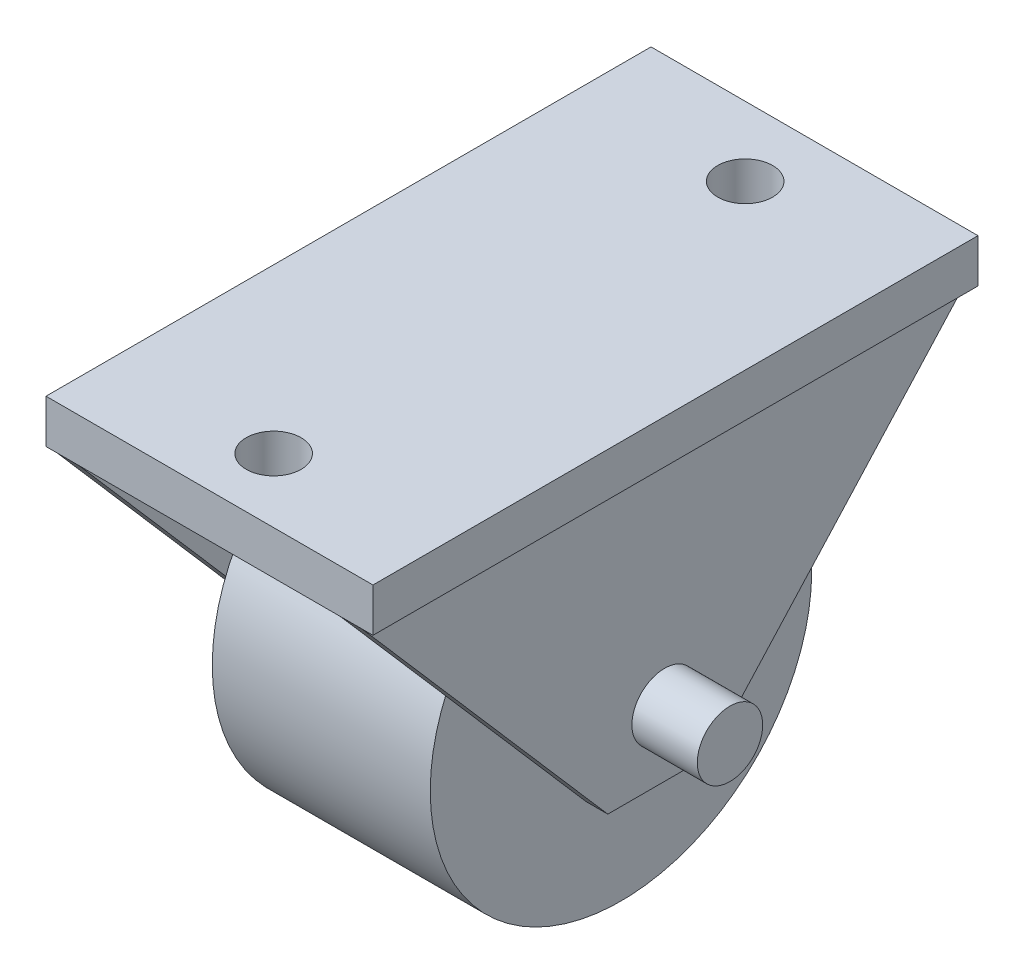
ISO-10303-21;
HEADER;
FILE_DESCRIPTION(('STEP AP214'),'2;1');
FILE_NAME('part.step','',(''),(''),'','','');
FILE_SCHEMA(('AUTOMOTIVE_DESIGN { 1 0 10303 214 1 1 1 1 }'));
ENDSEC;
DATA;
#1=APPLICATION_CONTEXT('core data for automotive mechanical design processes');
#2=APPLICATION_PROTOCOL_DEFINITION('international standard','automotive_design',2000,#1);
#3=PRODUCT_CONTEXT('',#1,'mechanical');
#4=PRODUCT('Part','Part','',(#3));
#5=PRODUCT_RELATED_PRODUCT_CATEGORY('part','',(#4));
#6=PRODUCT_DEFINITION_FORMATION('','',#4);
#7=PRODUCT_DEFINITION_CONTEXT('part definition',#1,'design');
#8=PRODUCT_DEFINITION('design','',#6,#7);
#9=PRODUCT_DEFINITION_SHAPE('','',#8);
#10=(LENGTH_UNIT() NAMED_UNIT(*) SI_UNIT(.MILLI.,.METRE.));
#11=(NAMED_UNIT(*) PLANE_ANGLE_UNIT() SI_UNIT($,.RADIAN.));
#12=(NAMED_UNIT(*) SI_UNIT($,.STERADIAN.) SOLID_ANGLE_UNIT());
#13=UNCERTAINTY_MEASURE_WITH_UNIT(LENGTH_MEASURE(1.E-05),#10,'distance_accuracy_value','');
#14=(GEOMETRIC_REPRESENTATION_CONTEXT(3) GLOBAL_UNCERTAINTY_ASSIGNED_CONTEXT((#13)) GLOBAL_UNIT_ASSIGNED_CONTEXT((#10,
#11,#12)) REPRESENTATION_CONTEXT('',''));
#15=CARTESIAN_POINT('',(0.,0.,0.));
#16=DIRECTION('',(0.,0.,1.));
#17=DIRECTION('',(1.,0.,0.));
#18=AXIS2_PLACEMENT_3D('',#15,#16,#17);
#19=CARTESIAN_POINT('',(0.,10.,0.));
#20=DIRECTION('',(0.,-1.,0.));
#21=DIRECTION('',(0.,0.,-1.));
#22=AXIS2_PLACEMENT_3D('',#19,#20,#21);
#23=PLANE('',#22);
#24=DIRECTION('',(-1.,0.,0.));
#25=VECTOR('',#24,1.);
#26=CARTESIAN_POINT('',(-7.5,10.,-13.8779468739856));
#27=LINE('',#26,#25);
#28=CARTESIAN_POINT('',(-7.,10.,-13.8779468739856));
#29=VERTEX_POINT('',#28);
#30=CARTESIAN_POINT('',(-7.5,10.,-13.8779468739856));
#31=VERTEX_POINT('',#30);
#32=EDGE_CURVE('E169',#29,#31,#27,.T.);
#33=ORIENTED_EDGE('',*,*,#32,.F.);
#34=DIRECTION('',(0.,0.,1.));
#35=VECTOR('',#34,1.);
#36=CARTESIAN_POINT('',(-7.,10.,-13.8779468739856));
#37=LINE('',#36,#35);
#38=CARTESIAN_POINT('',(-7.,10.,13.8779468739856));
#39=VERTEX_POINT('',#38);
#40=EDGE_CURVE('E158',#29,#39,#37,.T.);
#41=ORIENTED_EDGE('',*,*,#40,.T.);
#42=DIRECTION('',(1.,0.,0.));
#43=VECTOR('',#42,1.);
#44=CARTESIAN_POINT('',(-7.5,10.,13.8779468739856));
#45=LINE('',#44,#43);
#46=CARTESIAN_POINT('',(-7.5,10.,13.8779468739856));
#47=VERTEX_POINT('',#46);
#48=EDGE_CURVE('E168',#47,#39,#45,.T.);
#49=ORIENTED_EDGE('',*,*,#48,.F.);
#50=DIRECTION('',(0.,0.,1.));
#51=VECTOR('',#50,1.);
#52=CARTESIAN_POINT('',(-7.5,10.,13.8779468739856));
#53=LINE('',#52,#51);
#54=EDGE_CURVE('E192',#31,#47,#53,.T.);
#55=ORIENTED_EDGE('',*,*,#54,.F.);
#56=EDGE_LOOP('',(#33,#41,#49,#55));
#57=FACE_BOUND('',#56,.T.);
#58=ADVANCED_FACE('F39',(#57),#23,.T.);
#59=CARTESIAN_POINT('',(-10.,0.,0.));
#60=DIRECTION('',(1.,0.,0.));
#61=DIRECTION('',(0.,0.,-1.));
#62=AXIS2_PLACEMENT_3D('',#59,#60,#61);
#63=CYLINDRICAL_SURFACE('',#62,1.5);
#64=CARTESIAN_POINT('',(5.,0.,0.));
#65=DIRECTION('',(1.,0.,0.));
#66=DIRECTION('',(0.,0.,-1.));
#67=AXIS2_PLACEMENT_3D('',#64,#65,#66);
#68=CIRCLE('',#67,1.5);
#69=CARTESIAN_POINT('',(5.,0.,-1.5));
#70=VERTEX_POINT('',#69);
#71=EDGE_CURVE('E337',#70,#70,#68,.T.);
#72=ORIENTED_EDGE('',*,*,#71,.T.);
#73=EDGE_LOOP('',(#72));
#74=FACE_BOUND('',#73,.T.);
#75=CARTESIAN_POINT('',(6.,0.,0.));
#76=DIRECTION('',(1.,0.,0.));
#77=DIRECTION('',(0.,0.,-1.));
#78=AXIS2_PLACEMENT_3D('',#75,#76,#77);
#79=CIRCLE('',#78,1.5);
#80=CARTESIAN_POINT('',(6.,0.,-1.5));
#81=VERTEX_POINT('',#80);
#82=EDGE_CURVE('E324',#81,#81,#79,.F.);
#83=ORIENTED_EDGE('',*,*,#82,.T.);
#84=EDGE_LOOP('',(#83));
#85=FACE_BOUND('',#84,.T.);
#86=ADVANCED_FACE('F352',(#74,#85),#63,.T.);
#87=CARTESIAN_POINT('',(5.,0.,0.));
#88=DIRECTION('',(1.,0.,0.));
#89=DIRECTION('',(0.,0.,-1.));
#90=AXIS2_PLACEMENT_3D('',#87,#88,#89);
#91=PLANE('',#90);
#92=CARTESIAN_POINT('',(5.,0.,0.));
#93=DIRECTION('',(1.,0.,0.));
#94=DIRECTION('',(0.,0.,-1.));
#95=AXIS2_PLACEMENT_3D('',#92,#93,#94);
#96=CIRCLE('',#95,8.75);
#97=CARTESIAN_POINT('',(5.,0.,-8.75));
#98=VERTEX_POINT('',#97);
#99=EDGE_CURVE('E342',#98,#98,#96,.T.);
#100=ORIENTED_EDGE('',*,*,#99,.T.);
#101=EDGE_LOOP('',(#100));
#102=FACE_BOUND('',#101,.T.);
#103=ORIENTED_EDGE('',*,*,#71,.F.);
#104=EDGE_LOOP('',(#103));
#105=FACE_BOUND('',#104,.T.);
#106=ADVANCED_FACE('F433',(#102,#105),#91,.T.);
#107=CARTESIAN_POINT('',(-5.,0.,0.));
#108=DIRECTION('',(1.,0.,0.));
#109=DIRECTION('',(0.,0.,-1.));
#110=AXIS2_PLACEMENT_3D('',#107,#108,#109);
#111=PLANE('',#110);
#112=CARTESIAN_POINT('',(-5.,0.,0.));
#113=DIRECTION('',(1.,0.,0.));
#114=DIRECTION('',(0.,0.,-1.));
#115=AXIS2_PLACEMENT_3D('',#112,#113,#114);
#116=CIRCLE('',#115,8.75);
#117=CARTESIAN_POINT('',(-5.,0.,-8.75));
#118=VERTEX_POINT('',#117);
#119=EDGE_CURVE('E341',#118,#118,#116,.T.);
#120=ORIENTED_EDGE('',*,*,#119,.F.);
#121=EDGE_LOOP('',(#120));
#122=FACE_BOUND('',#121,.T.);
#123=CARTESIAN_POINT('',(-5.,0.,0.));
#124=DIRECTION('',(1.,0.,0.));
#125=DIRECTION('',(0.,0.,-1.));
#126=AXIS2_PLACEMENT_3D('',#123,#124,#125);
#127=CIRCLE('',#126,1.5);
#128=CARTESIAN_POINT('',(-5.,0.,-1.5));
#129=VERTEX_POINT('',#128);
#130=EDGE_CURVE('E329',#129,#129,#127,.T.);
#131=ORIENTED_EDGE('',*,*,#130,.T.);
#132=EDGE_LOOP('',(#131));
#133=FACE_BOUND('',#132,.T.);
#134=ADVANCED_FACE('F428',(#122,#133),#111,.F.);
#135=CARTESIAN_POINT('',(5.,0.,0.));
#136=DIRECTION('',(-1.,0.,0.));
#137=DIRECTION('',(0.,0.,1.));
#138=AXIS2_PLACEMENT_3D('',#135,#136,#137);
#139=CYLINDRICAL_SURFACE('',#138,8.75);
#140=ORIENTED_EDGE('',*,*,#99,.F.);
#141=EDGE_LOOP('',(#140));
#142=FACE_BOUND('',#141,.T.);
#143=ORIENTED_EDGE('',*,*,#119,.T.);
#144=EDGE_LOOP('',(#143));
#145=FACE_BOUND('',#144,.T.);
#146=ADVANCED_FACE('F41',(#142,#145),#139,.T.);
#147=CARTESIAN_POINT('',(-6.,0.,0.));
#148=DIRECTION('',(1.,0.,0.));
#149=DIRECTION('',(0.,0.,-1.));
#150=AXIS2_PLACEMENT_3D('',#147,#148,#149);
#151=CIRCLE('',#150,1.5);
#152=CARTESIAN_POINT('',(-6.,0.,-1.5));
#153=VERTEX_POINT('',#152);
#154=EDGE_CURVE('E11',#153,#153,#151,.F.);
#155=ORIENTED_EDGE('',*,*,#154,.F.);
#156=EDGE_LOOP('',(#155));
#157=FACE_BOUND('',#156,.T.);
#158=ORIENTED_EDGE('',*,*,#130,.F.);
#159=EDGE_LOOP('',(#158));
#160=FACE_BOUND('',#159,.T.);
#161=ADVANCED_FACE('F408',(#157,#160),#63,.T.);
#162=CARTESIAN_POINT('',(7.,10.,13.8779468739856));
#163=DIRECTION('',(0.,0.655383717698866,-0.75529608934193));
#164=DIRECTION('',(0.,0.75529608934193,0.655383717698866));
#165=AXIS2_PLACEMENT_3D('',#162,#163,#164);
#166=PLANE('',#165);
#167=DIRECTION('',(0.,-0.75529608934193,-0.655383717698866));
#168=VECTOR('',#167,1.);
#169=CARTESIAN_POINT('',(6.,10.,13.8779468739856));
#170=LINE('',#169,#168);
#171=CARTESIAN_POINT('',(6.,10.,13.8779468739856));
#172=VERTEX_POINT('',#171);
#173=CARTESIAN_POINT('',(6.,-2.9913553612348,2.60511904561504));
#174=VERTEX_POINT('',#173);
#175=EDGE_CURVE('E307',#172,#174,#170,.T.);
#176=ORIENTED_EDGE('',*,*,#175,.T.);
#177=DIRECTION('',(-1.,0.,0.));
#178=VECTOR('',#177,1.);
#179=CARTESIAN_POINT('',(7.,-2.9913553612348,2.60511904561504));
#180=LINE('',#179,#178);
#181=CARTESIAN_POINT('',(7.,-2.9913553612348,2.60511904561504));
#182=VERTEX_POINT('',#181);
#183=EDGE_CURVE('E319',#182,#174,#180,.T.);
#184=ORIENTED_EDGE('',*,*,#183,.F.);
#185=DIRECTION('',(0.,-0.75529608934193,-0.655383717698866));
#186=VECTOR('',#185,1.);
#187=CARTESIAN_POINT('',(7.,10.,13.8779468739856));
#188=LINE('',#187,#186);
#189=CARTESIAN_POINT('',(7.,10.,13.8779468739856));
#190=VERTEX_POINT('',#189);
#191=EDGE_CURVE('E296',#190,#182,#188,.T.);
#192=ORIENTED_EDGE('',*,*,#191,.F.);
#193=DIRECTION('',(-1.,0.,0.));
#194=VECTOR('',#193,1.);
#195=CARTESIAN_POINT('',(7.,10.,13.8779468739856));
#196=LINE('',#195,#194);
#197=EDGE_CURVE('E86',#190,#172,#196,.T.);
#198=ORIENTED_EDGE('',*,*,#197,.T.);
#199=EDGE_LOOP('',(#176,#184,#192,#198));
#200=FACE_BOUND('',#199,.T.);
#201=ADVANCED_FACE('F366',(#200),#166,.F.);
#202=CARTESIAN_POINT('',(7.,-2.9913553612348,2.60511904561504));
#203=DIRECTION('',(0.,1.,0.));
#204=DIRECTION('',(0.,0.,1.));
#205=AXIS2_PLACEMENT_3D('',#202,#203,#204);
#206=PLANE('',#205);
#207=DIRECTION('',(0.,0.,-1.));
#208=VECTOR('',#207,1.);
#209=CARTESIAN_POINT('',(6.,-2.9913553612348,2.60511904561504));
#210=LINE('',#209,#208);
#211=CARTESIAN_POINT('',(6.,-2.9913553612348,-2.09765587921364));
#212=VERTEX_POINT('',#211);
#213=EDGE_CURVE('E79',#174,#212,#210,.T.);
#214=ORIENTED_EDGE('',*,*,#213,.T.);
#215=DIRECTION('',(-1.,0.,0.));
#216=VECTOR('',#215,1.);
#217=CARTESIAN_POINT('',(7.,-2.9913553612348,-2.09765587921364));
#218=LINE('',#217,#216);
#219=CARTESIAN_POINT('',(7.,-2.9913553612348,-2.09765587921364));
#220=VERTEX_POINT('',#219);
#221=EDGE_CURVE('E316',#220,#212,#218,.T.);
#222=ORIENTED_EDGE('',*,*,#221,.F.);
#223=DIRECTION('',(0.,0.,-1.));
#224=VECTOR('',#223,1.);
#225=CARTESIAN_POINT('',(7.,-2.9913553612348,2.60511904561504));
#226=LINE('',#225,#224);
#227=EDGE_CURVE('E65',#182,#220,#226,.T.);
#228=ORIENTED_EDGE('',*,*,#227,.F.);
#229=ORIENTED_EDGE('',*,*,#183,.T.);
#230=EDGE_LOOP('',(#214,#222,#228,#229));
#231=FACE_BOUND('',#230,.T.);
#232=ADVANCED_FACE('F426',(#231),#206,.F.);
#233=CARTESIAN_POINT('',(7.,-2.9913553612348,-2.09765587921364));
#234=DIRECTION('',(0.,0.67173464885528,0.740791847638238));
#235=DIRECTION('',(0.,-0.740791847638238,0.67173464885528));
#236=AXIS2_PLACEMENT_3D('',#233,#234,#235);
#237=PLANE('',#236);
#238=DIRECTION('',(0.,0.740791847638238,-0.671734648855279));
#239=VECTOR('',#238,1.);
#240=CARTESIAN_POINT('',(6.,-2.9913553612348,-2.09765587921364));
#241=LINE('',#240,#239);
#242=CARTESIAN_POINT('',(6.,10.,-13.8779468739856));
#243=VERTEX_POINT('',#242);
#244=EDGE_CURVE('E297',#212,#243,#241,.T.);
#245=ORIENTED_EDGE('',*,*,#244,.T.);
#246=DIRECTION('',(-1.,0.,0.));
#247=VECTOR('',#246,1.);
#248=CARTESIAN_POINT('',(7.,10.,-13.8779468739856));
#249=LINE('',#248,#247);
#250=CARTESIAN_POINT('',(7.,10.,-13.8779468739856));
#251=VERTEX_POINT('',#250);
#252=EDGE_CURVE('E274',#251,#243,#249,.T.);
#253=ORIENTED_EDGE('',*,*,#252,.F.);
#254=DIRECTION('',(0.,0.740791847638238,-0.671734648855279));
#255=VECTOR('',#254,1.);
#256=CARTESIAN_POINT('',(7.,-2.9913553612348,-2.09765587921364));
#257=LINE('',#256,#255);
#258=EDGE_CURVE('E302',#220,#251,#257,.T.);
#259=ORIENTED_EDGE('',*,*,#258,.F.);
#260=ORIENTED_EDGE('',*,*,#221,.T.);
#261=EDGE_LOOP('',(#245,#253,#259,#260));
#262=FACE_BOUND('',#261,.T.);
#263=ADVANCED_FACE('F495',(#262),#237,.F.);
#264=CARTESIAN_POINT('',(7.,0.,0.));
#265=DIRECTION('',(1.,0.,0.));
#266=DIRECTION('',(0.,0.,-1.));
#267=AXIS2_PLACEMENT_3D('',#264,#265,#266);
#268=PLANE('',#267);
#269=CARTESIAN_POINT('',(7.,0.,0.));
#270=DIRECTION('',(1.,0.,0.));
#271=DIRECTION('',(0.,0.,-1.));
#272=AXIS2_PLACEMENT_3D('',#269,#270,#271);
#273=CIRCLE('',#272,1.5);
#274=CARTESIAN_POINT('',(7.,0.,-1.5));
#275=VERTEX_POINT('',#274);
#276=EDGE_CURVE('E43',#275,#275,#273,.F.);
#277=ORIENTED_EDGE('',*,*,#276,.T.);
#278=EDGE_LOOP('',(#277));
#279=FACE_BOUND('',#278,.T.);
#280=DIRECTION('',(0.,0.,1.));
#281=VECTOR('',#280,1.);
#282=CARTESIAN_POINT('',(7.,10.,-13.8779468739856));
#283=LINE('',#282,#281);
#284=EDGE_CURVE('E292',#251,#190,#283,.T.);
#285=ORIENTED_EDGE('',*,*,#284,.T.);
#286=ORIENTED_EDGE('',*,*,#191,.T.);
#287=ORIENTED_EDGE('',*,*,#227,.T.);
#288=ORIENTED_EDGE('',*,*,#258,.T.);
#289=EDGE_LOOP('',(#285,#286,#287,#288));
#290=FACE_BOUND('',#289,.T.);
#291=ADVANCED_FACE('F358',(#279,#290),#268,.T.);
#292=CARTESIAN_POINT('',(6.,0.,0.));
#293=DIRECTION('',(1.,0.,0.));
#294=DIRECTION('',(0.,0.,-1.));
#295=AXIS2_PLACEMENT_3D('',#292,#293,#294);
#296=PLANE('',#295);
#297=ORIENTED_EDGE('',*,*,#82,.F.);
#298=EDGE_LOOP('',(#297));
#299=FACE_BOUND('',#298,.T.);
#300=DIRECTION('',(0.,0.,1.));
#301=VECTOR('',#300,1.);
#302=CARTESIAN_POINT('',(6.,10.,-13.8779468739856));
#303=LINE('',#302,#301);
#304=EDGE_CURVE('E288',#243,#172,#303,.T.);
#305=ORIENTED_EDGE('',*,*,#304,.F.);
#306=ORIENTED_EDGE('',*,*,#244,.F.);
#307=ORIENTED_EDGE('',*,*,#213,.F.);
#308=ORIENTED_EDGE('',*,*,#175,.F.);
#309=EDGE_LOOP('',(#305,#306,#307,#308));
#310=FACE_BOUND('',#309,.T.);
#311=ADVANCED_FACE('F354',(#299,#310),#296,.F.);
#312=CARTESIAN_POINT('',(10.,0.,0.));
#313=DIRECTION('',(1.,0.,0.));
#314=DIRECTION('',(0.,0.,-1.));
#315=AXIS2_PLACEMENT_3D('',#312,#313,#314);
#316=PLANE('',#315);
#317=CARTESIAN_POINT('',(10.,0.,0.));
#318=DIRECTION('',(1.,0.,0.));
#319=DIRECTION('',(0.,0.,-1.));
#320=AXIS2_PLACEMENT_3D('',#317,#318,#319);
#321=CIRCLE('',#320,1.5);
#322=CARTESIAN_POINT('',(10.,0.,-1.5));
#323=VERTEX_POINT('',#322);
#324=EDGE_CURVE('E330',#323,#323,#321,.T.);
#325=ORIENTED_EDGE('',*,*,#324,.T.);
#326=EDGE_LOOP('',(#325));
#327=FACE_BOUND('',#326,.T.);
#328=ADVANCED_FACE('F357',(#327),#316,.T.);
#329=ORIENTED_EDGE('',*,*,#276,.F.);
#330=EDGE_LOOP('',(#329));
#331=FACE_BOUND('',#330,.T.);
#332=ORIENTED_EDGE('',*,*,#324,.F.);
#333=EDGE_LOOP('',(#332));
#334=FACE_BOUND('',#333,.T.);
#335=ADVANCED_FACE('F401',(#331,#334),#63,.T.);
#336=ORIENTED_EDGE('',*,*,#284,.F.);
#337=CARTESIAN_POINT('',(7.5,10.,-13.8779468739856));
#338=VERTEX_POINT('',#337);
#339=EDGE_CURVE('E196',#338,#251,#27,.T.);
#340=ORIENTED_EDGE('',*,*,#339,.F.);
#341=DIRECTION('',(0.,0.,-1.));
#342=VECTOR('',#341,1.);
#343=CARTESIAN_POINT('',(7.5,10.,13.8779468739856));
#344=LINE('',#343,#342);
#345=CARTESIAN_POINT('',(7.5,10.,13.8779468739856));
#346=VERTEX_POINT('',#345);
#347=EDGE_CURVE('E204',#346,#338,#344,.T.);
#348=ORIENTED_EDGE('',*,*,#347,.F.);
#349=EDGE_CURVE('E183',#190,#346,#45,.T.);
#350=ORIENTED_EDGE('',*,*,#349,.F.);
#351=EDGE_LOOP('',(#336,#340,#348,#350));
#352=FACE_BOUND('',#351,.T.);
#353=ADVANCED_FACE('F369',(#352),#23,.T.);
#354=CARTESIAN_POINT('',(0.,12.,0.));
#355=DIRECTION('',(0.,-1.,0.));
#356=DIRECTION('',(0.,0.,-1.));
#357=AXIS2_PLACEMENT_3D('',#354,#355,#356);
#358=PLANE('',#357);
#359=DIRECTION('',(0.,0.,-1.));
#360=VECTOR('',#359,1.);
#361=CARTESIAN_POINT('',(7.5,12.,13.8779468739856));
#362=LINE('',#361,#360);
#363=CARTESIAN_POINT('',(7.5,12.,13.8779468739856));
#364=VERTEX_POINT('',#363);
#365=CARTESIAN_POINT('',(7.5,12.,-13.8779468739856));
#366=VERTEX_POINT('',#365);
#367=EDGE_CURVE('E180',#364,#366,#362,.T.);
#368=ORIENTED_EDGE('',*,*,#367,.T.);
#369=DIRECTION('',(-1.,0.,0.));
#370=VECTOR('',#369,1.);
#371=CARTESIAN_POINT('',(-7.5,12.,-13.8779468739856));
#372=LINE('',#371,#370);
#373=CARTESIAN_POINT('',(-7.5,12.,-13.8779468739856));
#374=VERTEX_POINT('',#373);
#375=EDGE_CURVE('E187',#366,#374,#372,.T.);
#376=ORIENTED_EDGE('',*,*,#375,.T.);
#377=DIRECTION('',(0.,0.,1.));
#378=VECTOR('',#377,1.);
#379=CARTESIAN_POINT('',(-7.5,12.,13.8779468739856));
#380=LINE('',#379,#378);
#381=CARTESIAN_POINT('',(-7.5,12.,13.8779468739856));
#382=VERTEX_POINT('',#381);
#383=EDGE_CURVE('E213',#374,#382,#380,.T.);
#384=ORIENTED_EDGE('',*,*,#383,.T.);
#385=DIRECTION('',(1.,0.,0.));
#386=VECTOR('',#385,1.);
#387=CARTESIAN_POINT('',(-7.5,12.,13.8779468739856));
#388=LINE('',#387,#386);
#389=EDGE_CURVE('E209',#382,#364,#388,.T.);
#390=ORIENTED_EDGE('',*,*,#389,.T.);
#391=EDGE_LOOP('',(#368,#376,#384,#390));
#392=FACE_BOUND('',#391,.T.);
#393=CARTESIAN_POINT('',(0.,12.,-10.696409262942));
#394=DIRECTION('',(0.,1.,0.));
#395=DIRECTION('',(0.,0.,1.));
#396=AXIS2_PLACEMENT_3D('',#393,#394,#395);
#397=CIRCLE('',#396,1.25928393524358);
#398=CARTESIAN_POINT('',(0.,12.,-9.43712532769846));
#399=VERTEX_POINT('',#398);
#400=EDGE_CURVE('E208',#399,#399,#397,.T.);
#401=ORIENTED_EDGE('',*,*,#400,.F.);
#402=EDGE_LOOP('',(#401));
#403=FACE_BOUND('',#402,.T.);
#404=CARTESIAN_POINT('',(0.,12.,10.9340618621186));
#405=DIRECTION('',(0.,1.,0.));
#406=DIRECTION('',(0.,0.,1.));
#407=AXIS2_PLACEMENT_3D('',#404,#405,#406);
#408=CIRCLE('',#407,1.25928393524358);
#409=CARTESIAN_POINT('',(0.,12.,12.1933457973622));
#410=VERTEX_POINT('',#409);
#411=EDGE_CURVE('E222',#410,#410,#408,.T.);
#412=ORIENTED_EDGE('',*,*,#411,.F.);
#413=EDGE_LOOP('',(#412));
#414=FACE_BOUND('',#413,.T.);
#415=ADVANCED_FACE('F377',(#392,#403,#414),#358,.F.);
#416=DIRECTION('',(0.,0.,1.));
#417=VECTOR('',#416,1.);
#418=CARTESIAN_POINT('',(-6.,10.,-13.8779468739856));
#419=LINE('',#418,#417);
#420=CARTESIAN_POINT('',(-6.,10.,-13.8779468739856));
#421=VERTEX_POINT('',#420);
#422=CARTESIAN_POINT('',(-6.,10.,13.8779468739856));
#423=VERTEX_POINT('',#422);
#424=EDGE_CURVE('E56',#421,#423,#419,.T.);
#425=ORIENTED_EDGE('',*,*,#424,.F.);
#426=EDGE_CURVE('E201',#243,#421,#27,.T.);
#427=ORIENTED_EDGE('',*,*,#426,.F.);
#428=ORIENTED_EDGE('',*,*,#304,.T.);
#429=EDGE_CURVE('E181',#423,#172,#45,.T.);
#430=ORIENTED_EDGE('',*,*,#429,.F.);
#431=EDGE_LOOP('',(#425,#427,#428,#430));
#432=FACE_BOUND('',#431,.T.);
#433=CARTESIAN_POINT('',(0.,10.,-10.696409262942));
#434=DIRECTION('',(0.,1.,0.));
#435=DIRECTION('',(0.,0.,1.));
#436=AXIS2_PLACEMENT_3D('',#433,#434,#435);
#437=CIRCLE('',#436,1.25928393524358);
#438=CARTESIAN_POINT('',(0.,10.,-9.43712532769846));
#439=VERTEX_POINT('',#438);
#440=EDGE_CURVE('E218',#439,#439,#437,.T.);
#441=ORIENTED_EDGE('',*,*,#440,.T.);
#442=EDGE_LOOP('',(#441));
#443=FACE_BOUND('',#442,.T.);
#444=CARTESIAN_POINT('',(0.,10.,10.9340618621186));
#445=DIRECTION('',(0.,1.,0.));
#446=DIRECTION('',(0.,0.,1.));
#447=AXIS2_PLACEMENT_3D('',#444,#445,#446);
#448=CIRCLE('',#447,1.25928393524358);
#449=CARTESIAN_POINT('',(0.,10.,12.1933457973622));
#450=VERTEX_POINT('',#449);
#451=EDGE_CURVE('E226',#450,#450,#448,.T.);
#452=ORIENTED_EDGE('',*,*,#451,.T.);
#453=EDGE_LOOP('',(#452));
#454=FACE_BOUND('',#453,.T.);
#455=ADVANCED_FACE('F267',(#432,#443,#454),#23,.T.);
#456=CARTESIAN_POINT('',(7.5,12.,13.8779468739856));
#457=DIRECTION('',(-1.,0.,0.));
#458=DIRECTION('',(0.,0.,1.));
#459=AXIS2_PLACEMENT_3D('',#456,#457,#458);
#460=PLANE('',#459);
#461=ORIENTED_EDGE('',*,*,#347,.T.);
#462=DIRECTION('',(0.,-1.,0.));
#463=VECTOR('',#462,1.);
#464=CARTESIAN_POINT('',(7.5,12.,-13.8779468739856));
#465=LINE('',#464,#463);
#466=EDGE_CURVE('E283',#366,#338,#465,.T.);
#467=ORIENTED_EDGE('',*,*,#466,.F.);
#468=ORIENTED_EDGE('',*,*,#367,.F.);
#469=DIRECTION('',(0.,-1.,0.));
#470=VECTOR('',#469,1.);
#471=CARTESIAN_POINT('',(7.5,12.,13.8779468739856));
#472=LINE('',#471,#470);
#473=EDGE_CURVE('E212',#364,#346,#472,.T.);
#474=ORIENTED_EDGE('',*,*,#473,.T.);
#475=EDGE_LOOP('',(#461,#467,#468,#474));
#476=FACE_BOUND('',#475,.T.);
#477=ADVANCED_FACE('F374',(#476),#460,.F.);
#478=CARTESIAN_POINT('',(-7.5,12.,-13.8779468739856));
#479=DIRECTION('',(0.,0.,1.));
#480=DIRECTION('',(1.,0.,0.));
#481=AXIS2_PLACEMENT_3D('',#478,#479,#480);
#482=PLANE('',#481);
#483=ORIENTED_EDGE('',*,*,#339,.T.);
#484=ORIENTED_EDGE('',*,*,#252,.T.);
#485=ORIENTED_EDGE('',*,*,#426,.T.);
#486=DIRECTION('',(1.,0.,0.));
#487=VECTOR('',#486,1.);
#488=CARTESIAN_POINT('',(-7.,10.,-13.8779468739856));
#489=LINE('',#488,#487);
#490=EDGE_CURVE('E236',#29,#421,#489,.T.);
#491=ORIENTED_EDGE('',*,*,#490,.F.);
#492=ORIENTED_EDGE('',*,*,#32,.T.);
#493=DIRECTION('',(0.,-1.,0.));
#494=VECTOR('',#493,1.);
#495=CARTESIAN_POINT('',(-7.5,12.,-13.8779468739856));
#496=LINE('',#495,#494);
#497=EDGE_CURVE('E279',#374,#31,#496,.T.);
#498=ORIENTED_EDGE('',*,*,#497,.F.);
#499=ORIENTED_EDGE('',*,*,#375,.F.);
#500=ORIENTED_EDGE('',*,*,#466,.T.);
#501=EDGE_LOOP('',(#483,#484,#485,#491,#492,#498,#499,#500));
#502=FACE_BOUND('',#501,.T.);
#503=ADVANCED_FACE('F272',(#502),#482,.F.);
#504=CARTESIAN_POINT('',(-7.5,12.,13.8779468739856));
#505=DIRECTION('',(1.,0.,0.));
#506=DIRECTION('',(0.,0.,-1.));
#507=AXIS2_PLACEMENT_3D('',#504,#505,#506);
#508=PLANE('',#507);
#509=ORIENTED_EDGE('',*,*,#54,.T.);
#510=DIRECTION('',(0.,-1.,0.));
#511=VECTOR('',#510,1.);
#512=CARTESIAN_POINT('',(-7.5,12.,13.8779468739856));
#513=LINE('',#512,#511);
#514=EDGE_CURVE('E178',#382,#47,#513,.T.);
#515=ORIENTED_EDGE('',*,*,#514,.F.);
#516=ORIENTED_EDGE('',*,*,#383,.F.);
#517=ORIENTED_EDGE('',*,*,#497,.T.);
#518=EDGE_LOOP('',(#509,#515,#516,#517));
#519=FACE_BOUND('',#518,.T.);
#520=ADVANCED_FACE('F281',(#519),#508,.F.);
#521=CARTESIAN_POINT('',(-7.5,12.,13.8779468739856));
#522=DIRECTION('',(0.,0.,-1.));
#523=DIRECTION('',(-1.,0.,0.));
#524=AXIS2_PLACEMENT_3D('',#521,#522,#523);
#525=PLANE('',#524);
#526=ORIENTED_EDGE('',*,*,#48,.T.);
#527=DIRECTION('',(1.,0.,0.));
#528=VECTOR('',#527,1.);
#529=CARTESIAN_POINT('',(-7.,10.,13.8779468739856));
#530=LINE('',#529,#528);
#531=EDGE_CURVE('E142',#39,#423,#530,.T.);
#532=ORIENTED_EDGE('',*,*,#531,.T.);
#533=ORIENTED_EDGE('',*,*,#429,.T.);
#534=ORIENTED_EDGE('',*,*,#197,.F.);
#535=ORIENTED_EDGE('',*,*,#349,.T.);
#536=ORIENTED_EDGE('',*,*,#473,.F.);
#537=ORIENTED_EDGE('',*,*,#389,.F.);
#538=ORIENTED_EDGE('',*,*,#514,.T.);
#539=EDGE_LOOP('',(#526,#532,#533,#534,#535,#536,#537,#538));
#540=FACE_BOUND('',#539,.T.);
#541=ADVANCED_FACE('F175',(#540),#525,.F.);
#542=CARTESIAN_POINT('',(0.,12.,-10.696409262942));
#543=DIRECTION('',(0.,-1.,0.));
#544=DIRECTION('',(0.,0.,-1.));
#545=AXIS2_PLACEMENT_3D('',#542,#543,#544);
#546=CYLINDRICAL_SURFACE('',#545,1.25928393524358);
#547=ORIENTED_EDGE('',*,*,#400,.T.);
#548=EDGE_LOOP('',(#547));
#549=FACE_BOUND('',#548,.T.);
#550=ORIENTED_EDGE('',*,*,#440,.F.);
#551=EDGE_LOOP('',(#550));
#552=FACE_BOUND('',#551,.T.);
#553=ADVANCED_FACE('F388',(#549,#552),#546,.F.);
#554=CARTESIAN_POINT('',(0.,12.,10.9340618621186));
#555=DIRECTION('',(0.,-1.,0.));
#556=DIRECTION('',(0.,0.,-1.));
#557=AXIS2_PLACEMENT_3D('',#554,#555,#556);
#558=CYLINDRICAL_SURFACE('',#557,1.25928393524358);
#559=ORIENTED_EDGE('',*,*,#411,.T.);
#560=EDGE_LOOP('',(#559));
#561=FACE_BOUND('',#560,.T.);
#562=ORIENTED_EDGE('',*,*,#451,.F.);
#563=EDGE_LOOP('',(#562));
#564=FACE_BOUND('',#563,.T.);
#565=ADVANCED_FACE('F385',(#561,#564),#558,.F.);
#566=CARTESIAN_POINT('',(-7.,-2.9913553612348,-2.09765587921364));
#567=DIRECTION('',(0.,-0.67173464885528,-0.740791847638238));
#568=DIRECTION('',(0.,0.740791847638238,-0.67173464885528));
#569=AXIS2_PLACEMENT_3D('',#566,#567,#568);
#570=PLANE('',#569);
#571=DIRECTION('',(0.,0.740791847638238,-0.671734648855279));
#572=VECTOR('',#571,1.);
#573=CARTESIAN_POINT('',(-6.,-2.9913553612348,-2.09765587921364));
#574=LINE('',#573,#572);
#575=CARTESIAN_POINT('',(-6.,-2.9913553612348,-2.09765587921364));
#576=VERTEX_POINT('',#575);
#577=EDGE_CURVE('E172',#576,#421,#574,.T.);
#578=ORIENTED_EDGE('',*,*,#577,.F.);
#579=DIRECTION('',(1.,0.,0.));
#580=VECTOR('',#579,1.);
#581=CARTESIAN_POINT('',(-7.,-2.9913553612348,-2.09765587921364));
#582=LINE('',#581,#580);
#583=CARTESIAN_POINT('',(-7.,-2.9913553612348,-2.09765587921364));
#584=VERTEX_POINT('',#583);
#585=EDGE_CURVE('E240',#584,#576,#582,.T.);
#586=ORIENTED_EDGE('',*,*,#585,.F.);
#587=DIRECTION('',(0.,0.740791847638238,-0.671734648855279));
#588=VECTOR('',#587,1.);
#589=CARTESIAN_POINT('',(-7.,-2.9913553612348,-2.09765587921364));
#590=LINE('',#589,#588);
#591=EDGE_CURVE('E151',#584,#29,#590,.T.);
#592=ORIENTED_EDGE('',*,*,#591,.T.);
#593=ORIENTED_EDGE('',*,*,#490,.T.);
#594=EDGE_LOOP('',(#578,#586,#592,#593));
#595=FACE_BOUND('',#594,.T.);
#596=ADVANCED_FACE('F263',(#595),#570,.T.);
#597=CARTESIAN_POINT('',(-7.,-2.9913553612348,2.60511904561504));
#598=DIRECTION('',(0.,-1.,0.));
#599=DIRECTION('',(0.,0.,-1.));
#600=AXIS2_PLACEMENT_3D('',#597,#598,#599);
#601=PLANE('',#600);
#602=DIRECTION('',(0.,0.,-1.));
#603=VECTOR('',#602,1.);
#604=CARTESIAN_POINT('',(-6.,-2.9913553612348,2.60511904561504));
#605=LINE('',#604,#603);
#606=CARTESIAN_POINT('',(-6.,-2.9913553612348,2.60511904561504));
#607=VERTEX_POINT('',#606);
#608=EDGE_CURVE('E247',#607,#576,#605,.T.);
#609=ORIENTED_EDGE('',*,*,#608,.F.);
#610=DIRECTION('',(1.,0.,0.));
#611=VECTOR('',#610,1.);
#612=CARTESIAN_POINT('',(-7.,-2.9913553612348,2.60511904561504));
#613=LINE('',#612,#611);
#614=CARTESIAN_POINT('',(-7.,-2.9913553612348,2.60511904561504));
#615=VERTEX_POINT('',#614);
#616=EDGE_CURVE('E150',#615,#607,#613,.T.);
#617=ORIENTED_EDGE('',*,*,#616,.F.);
#618=DIRECTION('',(0.,0.,-1.));
#619=VECTOR('',#618,1.);
#620=CARTESIAN_POINT('',(-7.,-2.9913553612348,2.60511904561504));
#621=LINE('',#620,#619);
#622=EDGE_CURVE('E161',#615,#584,#621,.T.);
#623=ORIENTED_EDGE('',*,*,#622,.T.);
#624=ORIENTED_EDGE('',*,*,#585,.T.);
#625=EDGE_LOOP('',(#609,#617,#623,#624));
#626=FACE_BOUND('',#625,.T.);
#627=ADVANCED_FACE('F260',(#626),#601,.T.);
#628=CARTESIAN_POINT('',(-7.,10.,13.8779468739856));
#629=DIRECTION('',(0.,-0.655383717698866,0.75529608934193));
#630=DIRECTION('',(0.,-0.75529608934193,-0.655383717698866));
#631=AXIS2_PLACEMENT_3D('',#628,#629,#630);
#632=PLANE('',#631);
#633=DIRECTION('',(0.,-0.75529608934193,-0.655383717698866));
#634=VECTOR('',#633,1.);
#635=CARTESIAN_POINT('',(-6.,10.,13.8779468739856));
#636=LINE('',#635,#634);
#637=EDGE_CURVE('E146',#423,#607,#636,.T.);
#638=ORIENTED_EDGE('',*,*,#637,.F.);
#639=ORIENTED_EDGE('',*,*,#531,.F.);
#640=DIRECTION('',(0.,-0.75529608934193,-0.655383717698866));
#641=VECTOR('',#640,1.);
#642=CARTESIAN_POINT('',(-7.,10.,13.8779468739856));
#643=LINE('',#642,#641);
#644=EDGE_CURVE('E145',#39,#615,#643,.T.);
#645=ORIENTED_EDGE('',*,*,#644,.T.);
#646=ORIENTED_EDGE('',*,*,#616,.T.);
#647=EDGE_LOOP('',(#638,#639,#645,#646));
#648=FACE_BOUND('',#647,.T.);
#649=ADVANCED_FACE('F144',(#648),#632,.T.);
#650=CARTESIAN_POINT('',(-7.,0.,0.));
#651=DIRECTION('',(1.,0.,0.));
#652=DIRECTION('',(0.,0.,-1.));
#653=AXIS2_PLACEMENT_3D('',#650,#651,#652);
#654=PLANE('',#653);
#655=CARTESIAN_POINT('',(-7.,0.,0.));
#656=DIRECTION('',(1.,0.,0.));
#657=DIRECTION('',(0.,0.,-1.));
#658=AXIS2_PLACEMENT_3D('',#655,#656,#657);
#659=CIRCLE('',#658,1.5);
#660=CARTESIAN_POINT('',(-7.,0.,-1.5));
#661=VERTEX_POINT('',#660);
#662=EDGE_CURVE('E230',#661,#661,#659,.F.);
#663=ORIENTED_EDGE('',*,*,#662,.F.);
#664=EDGE_LOOP('',(#663));
#665=FACE_BOUND('',#664,.T.);
#666=ORIENTED_EDGE('',*,*,#40,.F.);
#667=ORIENTED_EDGE('',*,*,#591,.F.);
#668=ORIENTED_EDGE('',*,*,#622,.F.);
#669=ORIENTED_EDGE('',*,*,#644,.F.);
#670=EDGE_LOOP('',(#666,#667,#668,#669));
#671=FACE_BOUND('',#670,.T.);
#672=ADVANCED_FACE('F156',(#665,#671),#654,.F.);
#673=CARTESIAN_POINT('',(-6.,0.,0.));
#674=DIRECTION('',(1.,0.,0.));
#675=DIRECTION('',(0.,0.,-1.));
#676=AXIS2_PLACEMENT_3D('',#673,#674,#675);
#677=PLANE('',#676);
#678=ORIENTED_EDGE('',*,*,#154,.T.);
#679=EDGE_LOOP('',(#678));
#680=FACE_BOUND('',#679,.T.);
#681=ORIENTED_EDGE('',*,*,#424,.T.);
#682=ORIENTED_EDGE('',*,*,#637,.T.);
#683=ORIENTED_EDGE('',*,*,#608,.T.);
#684=ORIENTED_EDGE('',*,*,#577,.T.);
#685=EDGE_LOOP('',(#681,#682,#683,#684));
#686=FACE_BOUND('',#685,.T.);
#687=ADVANCED_FACE('F264',(#680,#686),#677,.T.);
#688=CARTESIAN_POINT('',(-10.,0.,0.));
#689=DIRECTION('',(1.,0.,0.));
#690=DIRECTION('',(0.,0.,-1.));
#691=AXIS2_PLACEMENT_3D('',#688,#689,#690);
#692=PLANE('',#691);
#693=CARTESIAN_POINT('',(-10.,0.,0.));
#694=DIRECTION('',(1.,0.,0.));
#695=DIRECTION('',(0.,0.,-1.));
#696=AXIS2_PLACEMENT_3D('',#693,#694,#695);
#697=CIRCLE('',#696,1.5);
#698=CARTESIAN_POINT('',(-10.,0.,-1.5));
#699=VERTEX_POINT('',#698);
#700=EDGE_CURVE('E325',#699,#699,#697,.T.);
#701=ORIENTED_EDGE('',*,*,#700,.F.);
#702=EDGE_LOOP('',(#701));
#703=FACE_BOUND('',#702,.T.);
#704=ADVANCED_FACE('F418',(#703),#692,.F.);
#705=ORIENTED_EDGE('',*,*,#700,.T.);
#706=EDGE_LOOP('',(#705));
#707=FACE_BOUND('',#706,.T.);
#708=ORIENTED_EDGE('',*,*,#662,.T.);
#709=EDGE_LOOP('',(#708));
#710=FACE_BOUND('',#709,.T.);
#711=ADVANCED_FACE('F407',(#707,#710),#63,.T.);
#712=CLOSED_SHELL('',(#58,#86,#106,#134,#146,#161,#201,#232,#263,#291,#311,#328,#335,#353,#415,
#455,#477,#503,#520,#541,#553,#565,#596,#627,#649,#672,#687,#704,#711));
#713=MANIFOLD_SOLID_BREP('B2',#712);
#714=ADVANCED_BREP_SHAPE_REPRESENTATION('',(#18,#713),#14);
#715=SHAPE_DEFINITION_REPRESENTATION(#9,#714);
ENDSEC;
END-ISO-10303-21;
